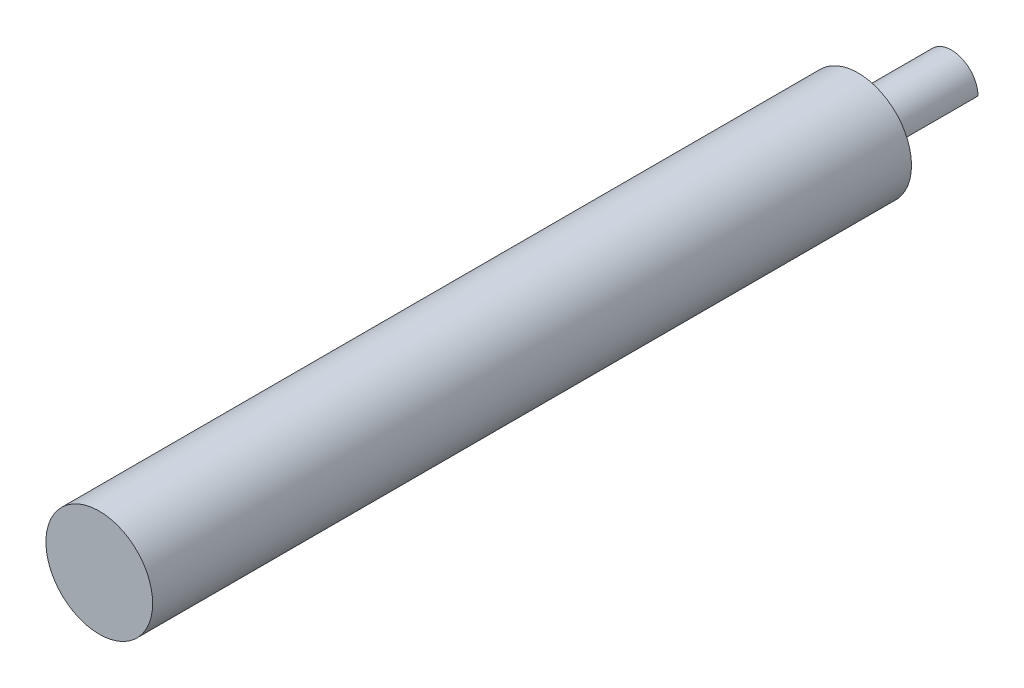
ISO-10303-21;
HEADER;
FILE_DESCRIPTION(('STEP AP214'),'2;1');
FILE_NAME('part.step','',(''),(''),'','','');
FILE_SCHEMA(('AUTOMOTIVE_DESIGN { 1 0 10303 214 1 1 1 1 }'));
ENDSEC;
DATA;
#1=APPLICATION_CONTEXT('core data for automotive mechanical design processes');
#2=APPLICATION_PROTOCOL_DEFINITION('international standard','automotive_design',2000,#1);
#3=PRODUCT_CONTEXT('',#1,'mechanical');
#4=PRODUCT('Part','Part','',(#3));
#5=PRODUCT_RELATED_PRODUCT_CATEGORY('part','',(#4));
#6=PRODUCT_DEFINITION_FORMATION('','',#4);
#7=PRODUCT_DEFINITION_CONTEXT('part definition',#1,'design');
#8=PRODUCT_DEFINITION('design','',#6,#7);
#9=PRODUCT_DEFINITION_SHAPE('','',#8);
#10=(LENGTH_UNIT() NAMED_UNIT(*) SI_UNIT(.MILLI.,.METRE.));
#11=(NAMED_UNIT(*) PLANE_ANGLE_UNIT() SI_UNIT($,.RADIAN.));
#12=(NAMED_UNIT(*) SI_UNIT($,.STERADIAN.) SOLID_ANGLE_UNIT());
#13=UNCERTAINTY_MEASURE_WITH_UNIT(LENGTH_MEASURE(1.E-05),#10,'distance_accuracy_value','');
#14=(GEOMETRIC_REPRESENTATION_CONTEXT(3) GLOBAL_UNCERTAINTY_ASSIGNED_CONTEXT((#13)) GLOBAL_UNIT_ASSIGNED_CONTEXT((#10,
#11,#12)) REPRESENTATION_CONTEXT('',''));
#15=CARTESIAN_POINT('',(0.,0.,0.));
#16=DIRECTION('',(0.,0.,1.));
#17=DIRECTION('',(1.,0.,0.));
#18=AXIS2_PLACEMENT_3D('',#15,#16,#17);
#19=CARTESIAN_POINT('',(0.,0.,9.8298));
#20=DIRECTION('',(0.,0.,1.));
#21=DIRECTION('',(1.,0.,0.));
#22=AXIS2_PLACEMENT_3D('',#19,#20,#21);
#23=TOROIDAL_SURFACE('',#22,4.4323,1.27);
#24=CARTESIAN_POINT('',(-0.00124959849113495,-3.16229975310748,9.82980000000001));
#25=CARTESIAN_POINT('',(-0.00124957741178906,-3.16229811745715,9.86368273358212));
#26=CARTESIAN_POINT('',(-0.000687823471624094,-3.16365691647431,9.89754833363963));
#27=CARTESIAN_POINT('',(0.00155259257160718,-3.1690654066029,9.96501897379135));
#28=CARTESIAN_POINT('',(0.00323099447268956,-3.17311447082681,9.99862407274257));
#29=CARTESIAN_POINT('',(0.00991457142013393,-3.18921173774372,10.098476649807));
#30=CARTESIAN_POINT('',(0.0165682493683373,-3.20521053626063,10.1640250543029));
#31=CARTESIAN_POINT('',(0.034082339681267,-3.24702683600815,10.29122918841));
#32=CARTESIAN_POINT('',(0.0449410215071336,-3.2728402980059,10.3528865072455));
#33=CARTESIAN_POINT('',(0.0705828293916468,-3.33324526871837,10.4708758025791));
#34=CARTESIAN_POINT('',(0.0853678231251591,-3.36784095463043,10.5272052273558));
#35=CARTESIAN_POINT('',(0.119086920879719,-3.44592073484124,10.6351379352964));
#36=CARTESIAN_POINT('',(0.138148420998815,-3.48967414350723,10.6865059950033));
#37=CARTESIAN_POINT('',(0.179647477390698,-3.58382631962201,10.7811514321807));
#38=CARTESIAN_POINT('',(0.202086185272415,-3.6342273531458,10.8244260384967));
#39=CARTESIAN_POINT('',(0.251507460954919,-3.74392029788479,10.9047871325068));
#40=CARTESIAN_POINT('',(0.278697398567073,-3.80358661742827,10.9412348944104));
#41=CARTESIAN_POINT('',(0.335727475538912,-3.92716869017088,11.0032467387697));
#42=CARTESIAN_POINT('',(0.365567974078507,-3.99108501899668,11.0288093434404));
#43=CARTESIAN_POINT('',(0.422020314321872,-4.11056368596208,11.0652226919363));
#44=CARTESIAN_POINT('',(0.448341496786497,-4.16574316067895,11.0778152166878));
#45=CARTESIAN_POINT('',(0.501837900512632,-4.27684601565396,11.0948811272541));
#46=CARTESIAN_POINT('',(0.529011245205959,-4.33276762370389,11.0993712315825));
#47=CARTESIAN_POINT('',(0.557692586470099,-4.39128127170086,11.0997902718681));
#48=CARTESIAN_POINT('',(0.559029675545877,-4.39400794881221,11.0998000265028));
#49=CARTESIAN_POINT('',(0.560367141106947,-4.39673423772322,11.0998));
#50=B_SPLINE_CURVE_WITH_KNOTS('',3,(#24,#25,#26,#27,#28,#29,#30,#31,#32,#33,#34,#35,#36,#37,#38,
#39,#40,#41,#42,#43,#44,#45,#46,#47,#48,#49),.UNSPECIFIED.,.F.,.F.,(4,2,2,2,2,2,2,2,2,2,2,2,4),
(0.,0.10158275773546,0.20314185288198,0.40547962960164,0.607734224019647,0.81008520012449,
1.01953723781687,1.22906085997758,1.45313992397563,1.6772493995912,1.86401176724498,
2.05038832732746,2.05949890878865),.UNSPECIFIED.);
#51=CARTESIAN_POINT('',(0.56036714110694,-4.39673423772323,11.0998));
#52=VERTEX_POINT('',#51);
#53=CARTESIAN_POINT('',(-0.00124959849113495,-3.16229975310748,9.82980000000001));
#54=VERTEX_POINT('',#53);
#55=EDGE_CURVE('E11',#52,#54,#50,.F.);
#56=ORIENTED_EDGE('',*,*,#55,.F.);
#57=CARTESIAN_POINT('',(0.,0.,11.0998));
#58=DIRECTION('',(0.,0.,1.));
#59=DIRECTION('',(1.,0.,0.));
#60=AXIS2_PLACEMENT_3D('',#57,#58,#59);
#61=CIRCLE('',#60,4.4323);
#62=CARTESIAN_POINT('',(4.39673423772323,-0.560367141106939,11.0998));
#63=VERTEX_POINT('',#62);
#64=EDGE_CURVE('E91',#63,#52,#61,.T.);
#65=ORIENTED_EDGE('',*,*,#64,.F.);
#66=CARTESIAN_POINT('',(3.16229975310748,0.00124959849113656,9.82980000000001));
#67=CARTESIAN_POINT('',(3.16229811745715,0.0012495774117901,9.86368273358212));
#68=CARTESIAN_POINT('',(3.16365691647431,0.000687823471624747,9.89754833363963));
#69=CARTESIAN_POINT('',(3.1690654066029,-0.00155259257160704,9.96501897379135));
#70=CARTESIAN_POINT('',(3.17311447082681,-0.00323099447268951,9.99862407274257));
#71=CARTESIAN_POINT('',(3.18921173774372,-0.00991457142013398,10.098476649807));
#72=CARTESIAN_POINT('',(3.20521053626063,-0.0165682493683372,10.1640250543029));
#73=CARTESIAN_POINT('',(3.24702683600815,-0.0340823396812663,10.29122918841));
#74=CARTESIAN_POINT('',(3.2728402980059,-0.0449410215071325,10.3528865072455));
#75=CARTESIAN_POINT('',(3.33324526871837,-0.070582829391646,10.4708758025791));
#76=CARTESIAN_POINT('',(3.36784095463043,-0.085367823125159,10.5272052273558));
#77=CARTESIAN_POINT('',(3.44592073484124,-0.119086920879719,10.6351379352964));
#78=CARTESIAN_POINT('',(3.48967414350723,-0.138148420998814,10.6865059950033));
#79=CARTESIAN_POINT('',(3.58382631962201,-0.179647477390697,10.7811514321807));
#80=CARTESIAN_POINT('',(3.6342273531458,-0.202086185272415,10.8244260384967));
#81=CARTESIAN_POINT('',(3.74392029788479,-0.251507460954918,10.9047871325068));
#82=CARTESIAN_POINT('',(3.80358661742827,-0.27869739856707,10.9412348944104));
#83=CARTESIAN_POINT('',(3.92716869017088,-0.335727475538912,11.0032467387697));
#84=CARTESIAN_POINT('',(3.99108501899668,-0.36556797407851,11.0288093434404));
#85=CARTESIAN_POINT('',(4.11056368596208,-0.422020314321871,11.0652226919363));
#86=CARTESIAN_POINT('',(4.16574316067895,-0.44834149678649,11.0778152166878));
#87=CARTESIAN_POINT('',(4.27684601565396,-0.501837900512636,11.0948811272541));
#88=CARTESIAN_POINT('',(4.33276762370388,-0.529011245205981,11.0993712315825));
#89=CARTESIAN_POINT('',(4.39128127170086,-0.557692586470101,11.0997902718681));
#90=CARTESIAN_POINT('',(4.39400794881221,-0.559029675545878,11.0998000265028));
#91=CARTESIAN_POINT('',(4.39673423772322,-0.560367141106947,11.0998));
#92=B_SPLINE_CURVE_WITH_KNOTS('',3,(#66,#67,#68,#69,#70,#71,#72,#73,#74,#75,#76,#77,#78,#79,#80,
#81,#82,#83,#84,#85,#86,#87,#88,#89,#90,#91),.UNSPECIFIED.,.F.,.F.,(4,2,2,2,2,2,2,2,2,2,2,2,4),
(0.,0.101582757735462,0.20314185288198,0.40547962960164,0.607734224019647,0.810085200124491,
1.01953723781687,1.22906085997758,1.45313992397563,1.6772493995912,1.86401176724498,
2.05038832732746,2.05949890878865),.UNSPECIFIED.);
#93=CARTESIAN_POINT('',(3.16229975310748,0.0012495984911356,9.82980000000001));
#94=VERTEX_POINT('',#93);
#95=EDGE_CURVE('E49',#63,#94,#92,.F.);
#96=ORIENTED_EDGE('',*,*,#95,.T.);
#97=CARTESIAN_POINT('',(0.,0.,9.8298));
#98=DIRECTION('',(0.,0.,1.));
#99=DIRECTION('',(1.,0.,0.));
#100=AXIS2_PLACEMENT_3D('',#97,#98,#99);
#101=CIRCLE('',#100,3.1623);
#102=EDGE_CURVE('E85',#54,#94,#101,.F.);
#103=ORIENTED_EDGE('',*,*,#102,.F.);
#104=EDGE_LOOP('',(#56,#65,#96,#103));
#105=FACE_BOUND('',#104,.T.);
#106=ADVANCED_FACE('F37',(#105),#23,.F.);
#107=CARTESIAN_POINT('',(2.47855068941509,-2.47855068941509,9.8298));
#108=DIRECTION('',(0.707106781186547,0.707106781186548,0.));
#109=DIRECTION('',(-0.707106781186548,0.707106781186547,0.));
#110=AXIS2_PLACEMENT_3D('',#107,#108,#109);
#111=CYLINDRICAL_SURFACE('',#110,1.27);
#112=DIRECTION('',(0.707106781186547,0.707106781186548,0.));
#113=VECTOR('',#112,1.);
#114=CARTESIAN_POINT('',(2.47855068941509,-2.47855068941509,11.0998));
#115=LINE('',#114,#113);
#116=EDGE_CURVE('E94',#52,#63,#115,.T.);
#117=ORIENTED_EDGE('',*,*,#116,.F.);
#118=ORIENTED_EDGE('',*,*,#55,.T.);
#119=DIRECTION('',(0.707106781186547,0.707106781186548,0.));
#120=VECTOR('',#119,1.);
#121=CARTESIAN_POINT('',(-0.00124959849113495,-3.16229975310748,9.8298));
#122=LINE('',#121,#120);
#123=EDGE_CURVE('E100',#94,#54,#122,.F.);
#124=ORIENTED_EDGE('',*,*,#123,.F.);
#125=ORIENTED_EDGE('',*,*,#95,.F.);
#126=EDGE_LOOP('',(#117,#118,#124,#125));
#127=FACE_BOUND('',#126,.T.);
#128=ADVANCED_FACE('F106',(#127),#111,.F.);
#129=CARTESIAN_POINT('',(0.,0.,11.0998));
#130=DIRECTION('',(0.,0.,-1.));
#131=DIRECTION('',(-1.,0.,0.));
#132=AXIS2_PLACEMENT_3D('',#129,#130,#131);
#133=CYLINDRICAL_SURFACE('',#132,3.1623);
#134=DIRECTION('',(0.,0.,1.));
#135=VECTOR('',#134,1.);
#136=CARTESIAN_POINT('',(-0.00124959849113495,-3.16229975310748,-31.6935730163358));
#137=LINE('',#136,#135);
#138=CARTESIAN_POINT('',(-0.00124959849113538,-3.16229975310748,0.));
#139=VERTEX_POINT('',#138);
#140=EDGE_CURVE('E88',#139,#54,#137,.T.);
#141=ORIENTED_EDGE('',*,*,#140,.T.);
#142=ORIENTED_EDGE('',*,*,#102,.T.);
#143=DIRECTION('',(0.,0.,1.));
#144=VECTOR('',#143,1.);
#145=CARTESIAN_POINT('',(3.16229975310748,0.0012495984911356,-31.6935730163358));
#146=LINE('',#145,#144);
#147=CARTESIAN_POINT('',(3.16229975310748,0.0012495984911356,0.));
#148=VERTEX_POINT('',#147);
#149=EDGE_CURVE('E81',#148,#94,#146,.T.);
#150=ORIENTED_EDGE('',*,*,#149,.F.);
#151=CARTESIAN_POINT('',(0.,0.,0.));
#152=DIRECTION('',(0.,0.,1.));
#153=DIRECTION('',(1.,0.,0.));
#154=AXIS2_PLACEMENT_3D('',#151,#152,#153);
#155=CIRCLE('',#154,3.1623);
#156=EDGE_CURVE('E73',#148,#139,#155,.T.);
#157=ORIENTED_EDGE('',*,*,#156,.T.);
#158=EDGE_LOOP('',(#141,#142,#150,#157));
#159=FACE_BOUND('',#158,.T.);
#160=ADVANCED_FACE('F84',(#159),#133,.T.);
#161=CARTESIAN_POINT('',(0.,0.,0.));
#162=DIRECTION('',(0.,0.,1.));
#163=DIRECTION('',(1.,0.,0.));
#164=AXIS2_PLACEMENT_3D('',#161,#162,#163);
#165=PLANE('',#164);
#166=DIRECTION('',(0.707106781186547,0.707106781186548,0.));
#167=VECTOR('',#166,1.);
#168=CARTESIAN_POINT('',(1.58052507730817,-1.58052507730817,0.));
#169=LINE('',#168,#167);
#170=EDGE_CURVE('E77',#139,#148,#169,.T.);
#171=ORIENTED_EDGE('',*,*,#170,.F.);
#172=ORIENTED_EDGE('',*,*,#156,.F.);
#173=EDGE_LOOP('',(#171,#172));
#174=FACE_BOUND('',#173,.T.);
#175=ADVANCED_FACE('F75',(#174),#165,.F.);
#176=CARTESIAN_POINT('',(-0.00124959849113495,-3.16229975310748,-31.6935730163358));
#177=DIRECTION('',(0.707106781186547,-0.707106781186547,0.));
#178=DIRECTION('',(0.707106781186547,0.707106781186548,0.));
#179=AXIS2_PLACEMENT_3D('',#176,#177,#178);
#180=PLANE('',#179);
#181=ORIENTED_EDGE('',*,*,#149,.T.);
#182=ORIENTED_EDGE('',*,*,#123,.T.);
#183=ORIENTED_EDGE('',*,*,#140,.F.);
#184=ORIENTED_EDGE('',*,*,#170,.T.);
#185=EDGE_LOOP('',(#181,#182,#183,#184));
#186=FACE_BOUND('',#185,.T.);
#187=ADVANCED_FACE('F90',(#186),#180,.T.);
#188=CARTESIAN_POINT('',(0.,0.,11.0998));
#189=DIRECTION('',(0.,0.,1.));
#190=DIRECTION('',(1.,0.,0.));
#191=AXIS2_PLACEMENT_3D('',#188,#189,#190);
#192=PLANE('',#191);
#193=ORIENTED_EDGE('',*,*,#64,.T.);
#194=ORIENTED_EDGE('',*,*,#116,.T.);
#195=EDGE_LOOP('',(#193,#194));
#196=FACE_BOUND('',#195,.T.);
#197=CARTESIAN_POINT('',(0.,0.,11.0998));
#198=DIRECTION('',(0.,0.,1.));
#199=DIRECTION('',(1.,0.,0.));
#200=AXIS2_PLACEMENT_3D('',#197,#198,#199);
#201=CIRCLE('',#200,6.35);
#202=CARTESIAN_POINT('',(6.35,0.,11.0998));
#203=VERTEX_POINT('',#202);
#204=EDGE_CURVE('E137',#203,#203,#201,.T.);
#205=ORIENTED_EDGE('',*,*,#204,.F.);
#206=EDGE_LOOP('',(#205));
#207=FACE_BOUND('',#206,.T.);
#208=ADVANCED_FACE('F117',(#196,#207),#192,.F.);
#209=CARTESIAN_POINT('',(0.,0.,101.3968));
#210=DIRECTION('',(0.,0.,-1.));
#211=DIRECTION('',(-1.,0.,0.));
#212=AXIS2_PLACEMENT_3D('',#209,#210,#211);
#213=CYLINDRICAL_SURFACE('',#212,6.35);
#214=CARTESIAN_POINT('',(0.,0.,101.3968));
#215=DIRECTION('',(0.,0.,1.));
#216=DIRECTION('',(1.,0.,0.));
#217=AXIS2_PLACEMENT_3D('',#214,#215,#216);
#218=CIRCLE('',#217,6.35);
#219=CARTESIAN_POINT('',(6.35,0.,101.3968));
#220=VERTEX_POINT('',#219);
#221=EDGE_CURVE('E139',#220,#220,#218,.T.);
#222=ORIENTED_EDGE('',*,*,#221,.F.);
#223=EDGE_LOOP('',(#222));
#224=FACE_BOUND('',#223,.T.);
#225=ORIENTED_EDGE('',*,*,#204,.T.);
#226=EDGE_LOOP('',(#225));
#227=FACE_BOUND('',#226,.T.);
#228=ADVANCED_FACE('F118',(#224,#227),#213,.T.);
#229=CARTESIAN_POINT('',(0.,0.,101.3968));
#230=DIRECTION('',(0.,0.,1.));
#231=DIRECTION('',(1.,0.,0.));
#232=AXIS2_PLACEMENT_3D('',#229,#230,#231);
#233=PLANE('',#232);
#234=ORIENTED_EDGE('',*,*,#221,.T.);
#235=EDGE_LOOP('',(#234));
#236=FACE_BOUND('',#235,.T.);
#237=ADVANCED_FACE('F121',(#236),#233,.T.);
#238=CLOSED_SHELL('',(#106,#128,#160,#175,#187,#208,#228,#237));
#239=MANIFOLD_SOLID_BREP('B2',#238);
#240=ADVANCED_BREP_SHAPE_REPRESENTATION('',(#18,#239),#14);
#241=SHAPE_DEFINITION_REPRESENTATION(#9,#240);
ENDSEC;
END-ISO-10303-21;
